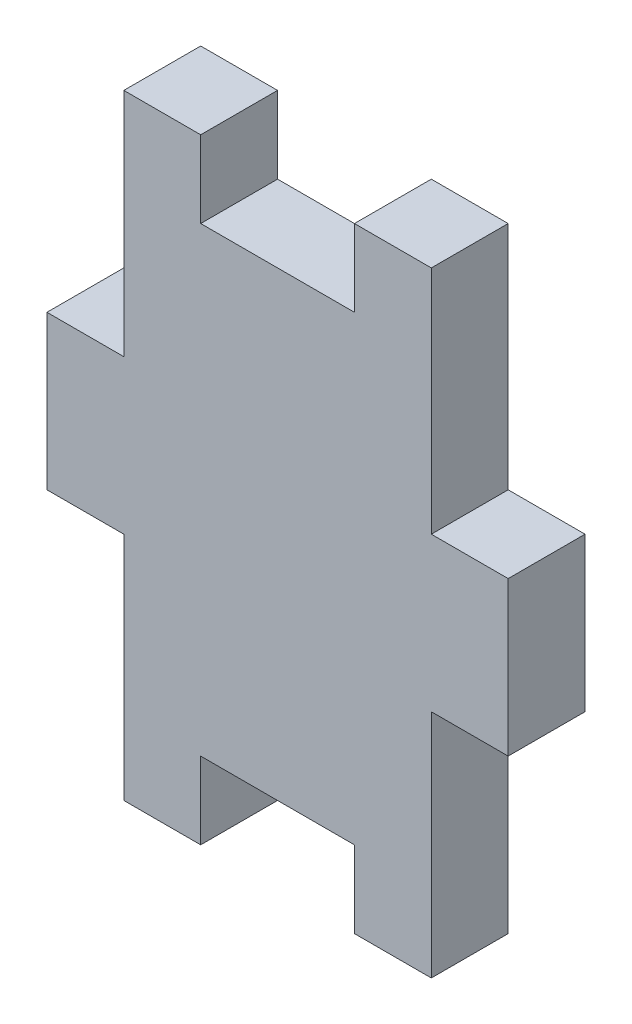
ISO-10303-21;
HEADER;
FILE_DESCRIPTION(('STEP AP214'),'2;1');
FILE_NAME('part.step','',(''),(''),'','','');
FILE_SCHEMA(('AUTOMOTIVE_DESIGN { 1 0 10303 214 1 1 1 1 }'));
ENDSEC;
DATA;
#1=APPLICATION_CONTEXT('core data for automotive mechanical design processes');
#2=APPLICATION_PROTOCOL_DEFINITION('international standard','automotive_design',2000,#1);
#3=PRODUCT_CONTEXT('',#1,'mechanical');
#4=PRODUCT('Part','Part','',(#3));
#5=PRODUCT_RELATED_PRODUCT_CATEGORY('part','',(#4));
#6=PRODUCT_DEFINITION_FORMATION('','',#4);
#7=PRODUCT_DEFINITION_CONTEXT('part definition',#1,'design');
#8=PRODUCT_DEFINITION('design','',#6,#7);
#9=PRODUCT_DEFINITION_SHAPE('','',#8);
#10=(LENGTH_UNIT() NAMED_UNIT(*) SI_UNIT(.MILLI.,.METRE.));
#11=(NAMED_UNIT(*) PLANE_ANGLE_UNIT() SI_UNIT($,.RADIAN.));
#12=(NAMED_UNIT(*) SI_UNIT($,.STERADIAN.) SOLID_ANGLE_UNIT());
#13=UNCERTAINTY_MEASURE_WITH_UNIT(LENGTH_MEASURE(1.E-05),#10,'distance_accuracy_value','');
#14=(GEOMETRIC_REPRESENTATION_CONTEXT(3) GLOBAL_UNCERTAINTY_ASSIGNED_CONTEXT((#13)) GLOBAL_UNIT_ASSIGNED_CONTEXT((#10,
#11,#12)) REPRESENTATION_CONTEXT('',''));
#15=CARTESIAN_POINT('',(0.,0.,0.));
#16=DIRECTION('',(0.,0.,1.));
#17=DIRECTION('',(1.,0.,0.));
#18=AXIS2_PLACEMENT_3D('',#15,#16,#17);
#19=CARTESIAN_POINT('',(-6.35,12.7,3.175));
#20=DIRECTION('',(1.,0.,0.));
#21=DIRECTION('',(0.,1.,0.));
#22=AXIS2_PLACEMENT_3D('',#19,#20,#21);
#23=PLANE('',#22);
#24=DIRECTION('',(0.,-1.,0.));
#25=VECTOR('',#24,1.);
#26=CARTESIAN_POINT('',(-6.35,12.7,0.));
#27=LINE('',#26,#25);
#28=CARTESIAN_POINT('',(-6.35,12.7,0.));
#29=VERTEX_POINT('',#28);
#30=CARTESIAN_POINT('',(-6.35,3.175,0.));
#31=VERTEX_POINT('',#30);
#32=EDGE_CURVE('E200',#29,#31,#27,.T.);
#33=ORIENTED_EDGE('',*,*,#32,.T.);
#34=DIRECTION('',(0.,0.,-1.));
#35=VECTOR('',#34,1.);
#36=CARTESIAN_POINT('',(-6.35,3.175,3.175));
#37=LINE('',#36,#35);
#38=CARTESIAN_POINT('',(-6.35,3.175,3.175));
#39=VERTEX_POINT('',#38);
#40=EDGE_CURVE('E11',#39,#31,#37,.T.);
#41=ORIENTED_EDGE('',*,*,#40,.F.);
#42=DIRECTION('',(0.,-1.,0.));
#43=VECTOR('',#42,1.);
#44=CARTESIAN_POINT('',(-6.35,12.7,3.175));
#45=LINE('',#44,#43);
#46=CARTESIAN_POINT('',(-6.35,12.7,3.175));
#47=VERTEX_POINT('',#46);
#48=EDGE_CURVE('E238',#47,#39,#45,.T.);
#49=ORIENTED_EDGE('',*,*,#48,.F.);
#50=DIRECTION('',(0.,0.,-1.));
#51=VECTOR('',#50,1.);
#52=CARTESIAN_POINT('',(-6.35,12.7,3.175));
#53=LINE('',#52,#51);
#54=EDGE_CURVE('E196',#47,#29,#53,.T.);
#55=ORIENTED_EDGE('',*,*,#54,.T.);
#56=EDGE_LOOP('',(#33,#41,#49,#55));
#57=FACE_BOUND('',#56,.T.);
#58=ADVANCED_FACE('F32',(#57),#23,.F.);
#59=CARTESIAN_POINT('',(-6.35,3.175,3.175));
#60=DIRECTION('',(0.,-1.,0.));
#61=DIRECTION('',(1.,0.,0.));
#62=AXIS2_PLACEMENT_3D('',#59,#60,#61);
#63=PLANE('',#62);
#64=DIRECTION('',(-1.,0.,0.));
#65=VECTOR('',#64,1.);
#66=CARTESIAN_POINT('',(-6.35,3.175,0.));
#67=LINE('',#66,#65);
#68=CARTESIAN_POINT('',(-9.525,3.175,0.));
#69=VERTEX_POINT('',#68);
#70=EDGE_CURVE('E203',#31,#69,#67,.T.);
#71=ORIENTED_EDGE('',*,*,#70,.T.);
#72=DIRECTION('',(0.,0.,-1.));
#73=VECTOR('',#72,1.);
#74=CARTESIAN_POINT('',(-9.525,3.175,3.175));
#75=LINE('',#74,#73);
#76=CARTESIAN_POINT('',(-9.525,3.175,3.175));
#77=VERTEX_POINT('',#76);
#78=EDGE_CURVE('E40',#77,#69,#75,.T.);
#79=ORIENTED_EDGE('',*,*,#78,.F.);
#80=DIRECTION('',(-1.,0.,0.));
#81=VECTOR('',#80,1.);
#82=CARTESIAN_POINT('',(-6.35,3.175,3.175));
#83=LINE('',#82,#81);
#84=EDGE_CURVE('E127',#39,#77,#83,.T.);
#85=ORIENTED_EDGE('',*,*,#84,.F.);
#86=ORIENTED_EDGE('',*,*,#40,.T.);
#87=EDGE_LOOP('',(#71,#79,#85,#86));
#88=FACE_BOUND('',#87,.T.);
#89=ADVANCED_FACE('F356',(#88),#63,.F.);
#90=CARTESIAN_POINT('',(-9.525,3.175,3.175));
#91=DIRECTION('',(1.,0.,0.));
#92=DIRECTION('',(0.,0.,-1.));
#93=AXIS2_PLACEMENT_3D('',#90,#91,#92);
#94=PLANE('',#93);
#95=DIRECTION('',(0.,-1.,0.));
#96=VECTOR('',#95,1.);
#97=CARTESIAN_POINT('',(-9.525,3.175,0.));
#98=LINE('',#97,#96);
#99=CARTESIAN_POINT('',(-9.525,-3.175,0.));
#100=VERTEX_POINT('',#99);
#101=EDGE_CURVE('E205',#69,#100,#98,.T.);
#102=ORIENTED_EDGE('',*,*,#101,.T.);
#103=DIRECTION('',(0.,0.,-1.));
#104=VECTOR('',#103,1.);
#105=CARTESIAN_POINT('',(-9.525,-3.175,3.175));
#106=LINE('',#105,#104);
#107=CARTESIAN_POINT('',(-9.525,-3.175,3.175));
#108=VERTEX_POINT('',#107);
#109=EDGE_CURVE('E281',#108,#100,#106,.T.);
#110=ORIENTED_EDGE('',*,*,#109,.F.);
#111=DIRECTION('',(0.,-1.,0.));
#112=VECTOR('',#111,1.);
#113=CARTESIAN_POINT('',(-9.525,3.175,3.175));
#114=LINE('',#113,#112);
#115=EDGE_CURVE('E289',#77,#108,#114,.T.);
#116=ORIENTED_EDGE('',*,*,#115,.F.);
#117=ORIENTED_EDGE('',*,*,#78,.T.);
#118=EDGE_LOOP('',(#102,#110,#116,#117));
#119=FACE_BOUND('',#118,.T.);
#120=ADVANCED_FACE('F287',(#119),#94,.F.);
#121=CARTESIAN_POINT('',(-6.35,-3.175,3.175));
#122=DIRECTION('',(0.,1.,0.));
#123=DIRECTION('',(-1.,0.,0.));
#124=AXIS2_PLACEMENT_3D('',#121,#122,#123);
#125=PLANE('',#124);
#126=DIRECTION('',(1.,0.,0.));
#127=VECTOR('',#126,1.);
#128=CARTESIAN_POINT('',(-6.35,-3.175,0.));
#129=LINE('',#128,#127);
#130=CARTESIAN_POINT('',(-6.35,-3.175,0.));
#131=VERTEX_POINT('',#130);
#132=EDGE_CURVE('E207',#100,#131,#129,.T.);
#133=ORIENTED_EDGE('',*,*,#132,.T.);
#134=DIRECTION('',(0.,0.,-1.));
#135=VECTOR('',#134,1.);
#136=CARTESIAN_POINT('',(-6.35,-3.175,3.175));
#137=LINE('',#136,#135);
#138=CARTESIAN_POINT('',(-6.35,-3.175,3.175));
#139=VERTEX_POINT('',#138);
#140=EDGE_CURVE('E278',#139,#131,#137,.T.);
#141=ORIENTED_EDGE('',*,*,#140,.F.);
#142=DIRECTION('',(1.,0.,0.));
#143=VECTOR('',#142,1.);
#144=CARTESIAN_POINT('',(-6.35,-3.175,3.175));
#145=LINE('',#144,#143);
#146=EDGE_CURVE('E307',#108,#139,#145,.T.);
#147=ORIENTED_EDGE('',*,*,#146,.F.);
#148=ORIENTED_EDGE('',*,*,#109,.T.);
#149=EDGE_LOOP('',(#133,#141,#147,#148));
#150=FACE_BOUND('',#149,.T.);
#151=ADVANCED_FACE('F298',(#150),#125,.F.);
#152=CARTESIAN_POINT('',(-6.35,-12.7,3.175));
#153=DIRECTION('',(1.,0.,0.));
#154=DIRECTION('',(0.,1.,0.));
#155=AXIS2_PLACEMENT_3D('',#152,#153,#154);
#156=PLANE('',#155);
#157=DIRECTION('',(0.,-1.,0.));
#158=VECTOR('',#157,1.);
#159=CARTESIAN_POINT('',(-6.35,-12.7,0.));
#160=LINE('',#159,#158);
#161=CARTESIAN_POINT('',(-6.35,-12.7,0.));
#162=VERTEX_POINT('',#161);
#163=EDGE_CURVE('E209',#131,#162,#160,.T.);
#164=ORIENTED_EDGE('',*,*,#163,.T.);
#165=DIRECTION('',(0.,0.,-1.));
#166=VECTOR('',#165,1.);
#167=CARTESIAN_POINT('',(-6.35,-12.7,3.175));
#168=LINE('',#167,#166);
#169=CARTESIAN_POINT('',(-6.35,-12.7,3.175));
#170=VERTEX_POINT('',#169);
#171=EDGE_CURVE('E275',#170,#162,#168,.T.);
#172=ORIENTED_EDGE('',*,*,#171,.F.);
#173=DIRECTION('',(0.,-1.,0.));
#174=VECTOR('',#173,1.);
#175=CARTESIAN_POINT('',(-6.35,-12.7,3.175));
#176=LINE('',#175,#174);
#177=EDGE_CURVE('E304',#139,#170,#176,.T.);
#178=ORIENTED_EDGE('',*,*,#177,.F.);
#179=ORIENTED_EDGE('',*,*,#140,.T.);
#180=EDGE_LOOP('',(#164,#172,#178,#179));
#181=FACE_BOUND('',#180,.T.);
#182=ADVANCED_FACE('F302',(#181),#156,.F.);
#183=CARTESIAN_POINT('',(-6.35,-12.7,3.175));
#184=DIRECTION('',(0.,1.,0.));
#185=DIRECTION('',(-1.,0.,0.));
#186=AXIS2_PLACEMENT_3D('',#183,#184,#185);
#187=PLANE('',#186);
#188=DIRECTION('',(1.,0.,0.));
#189=VECTOR('',#188,1.);
#190=CARTESIAN_POINT('',(-6.35,-12.7,0.));
#191=LINE('',#190,#189);
#192=CARTESIAN_POINT('',(-3.175,-12.7,0.));
#193=VERTEX_POINT('',#192);
#194=EDGE_CURVE('E211',#162,#193,#191,.T.);
#195=ORIENTED_EDGE('',*,*,#194,.T.);
#196=DIRECTION('',(0.,0.,-1.));
#197=VECTOR('',#196,1.);
#198=CARTESIAN_POINT('',(-3.175,-12.7,3.175));
#199=LINE('',#198,#197);
#200=CARTESIAN_POINT('',(-3.175,-12.7,3.175));
#201=VERTEX_POINT('',#200);
#202=EDGE_CURVE('E272',#201,#193,#199,.T.);
#203=ORIENTED_EDGE('',*,*,#202,.F.);
#204=DIRECTION('',(1.,0.,0.));
#205=VECTOR('',#204,1.);
#206=CARTESIAN_POINT('',(-6.35,-12.7,3.175));
#207=LINE('',#206,#205);
#208=EDGE_CURVE('E306',#170,#201,#207,.T.);
#209=ORIENTED_EDGE('',*,*,#208,.F.);
#210=ORIENTED_EDGE('',*,*,#171,.T.);
#211=EDGE_LOOP('',(#195,#203,#209,#210));
#212=FACE_BOUND('',#211,.T.);
#213=ADVANCED_FACE('F369',(#212),#187,.F.);
#214=CARTESIAN_POINT('',(-3.175,-12.7,3.175));
#215=DIRECTION('',(-1.,0.,0.));
#216=DIRECTION('',(0.,-1.,0.));
#217=AXIS2_PLACEMENT_3D('',#214,#215,#216);
#218=PLANE('',#217);
#219=DIRECTION('',(0.,1.,0.));
#220=VECTOR('',#219,1.);
#221=CARTESIAN_POINT('',(-3.175,-12.7,0.));
#222=LINE('',#221,#220);
#223=CARTESIAN_POINT('',(-3.175,-9.525,0.));
#224=VERTEX_POINT('',#223);
#225=EDGE_CURVE('E213',#193,#224,#222,.T.);
#226=ORIENTED_EDGE('',*,*,#225,.T.);
#227=DIRECTION('',(0.,0.,-1.));
#228=VECTOR('',#227,1.);
#229=CARTESIAN_POINT('',(-3.175,-9.525,3.175));
#230=LINE('',#229,#228);
#231=CARTESIAN_POINT('',(-3.175,-9.525,3.175));
#232=VERTEX_POINT('',#231);
#233=EDGE_CURVE('E269',#232,#224,#230,.T.);
#234=ORIENTED_EDGE('',*,*,#233,.F.);
#235=DIRECTION('',(0.,1.,0.));
#236=VECTOR('',#235,1.);
#237=CARTESIAN_POINT('',(-3.175,-12.7,3.175));
#238=LINE('',#237,#236);
#239=EDGE_CURVE('E309',#201,#232,#238,.T.);
#240=ORIENTED_EDGE('',*,*,#239,.F.);
#241=ORIENTED_EDGE('',*,*,#202,.T.);
#242=EDGE_LOOP('',(#226,#234,#240,#241));
#243=FACE_BOUND('',#242,.T.);
#244=ADVANCED_FACE('F372',(#243),#218,.F.);
#245=CARTESIAN_POINT('',(-3.175,-9.525,3.175));
#246=DIRECTION('',(0.,1.,0.));
#247=DIRECTION('',(0.,0.,1.));
#248=AXIS2_PLACEMENT_3D('',#245,#246,#247);
#249=PLANE('',#248);
#250=DIRECTION('',(1.,0.,0.));
#251=VECTOR('',#250,1.);
#252=CARTESIAN_POINT('',(-3.175,-9.525,0.));
#253=LINE('',#252,#251);
#254=CARTESIAN_POINT('',(3.175,-9.525,0.));
#255=VERTEX_POINT('',#254);
#256=EDGE_CURVE('E215',#224,#255,#253,.T.);
#257=ORIENTED_EDGE('',*,*,#256,.T.);
#258=DIRECTION('',(0.,0.,-1.));
#259=VECTOR('',#258,1.);
#260=CARTESIAN_POINT('',(3.175,-9.525,3.175));
#261=LINE('',#260,#259);
#262=CARTESIAN_POINT('',(3.175,-9.525,3.175));
#263=VERTEX_POINT('',#262);
#264=EDGE_CURVE('E266',#263,#255,#261,.T.);
#265=ORIENTED_EDGE('',*,*,#264,.F.);
#266=DIRECTION('',(1.,0.,0.));
#267=VECTOR('',#266,1.);
#268=CARTESIAN_POINT('',(-3.175,-9.525,3.175));
#269=LINE('',#268,#267);
#270=EDGE_CURVE('E315',#232,#263,#269,.T.);
#271=ORIENTED_EDGE('',*,*,#270,.F.);
#272=ORIENTED_EDGE('',*,*,#233,.T.);
#273=EDGE_LOOP('',(#257,#265,#271,#272));
#274=FACE_BOUND('',#273,.T.);
#275=ADVANCED_FACE('F376',(#274),#249,.F.);
#276=CARTESIAN_POINT('',(3.175,-9.525,3.175));
#277=DIRECTION('',(1.,0.,0.));
#278=DIRECTION('',(0.,1.,0.));
#279=AXIS2_PLACEMENT_3D('',#276,#277,#278);
#280=PLANE('',#279);
#281=DIRECTION('',(0.,-1.,0.));
#282=VECTOR('',#281,1.);
#283=CARTESIAN_POINT('',(3.175,-9.525,0.));
#284=LINE('',#283,#282);
#285=CARTESIAN_POINT('',(3.175,-12.7,0.));
#286=VERTEX_POINT('',#285);
#287=EDGE_CURVE('E217',#255,#286,#284,.T.);
#288=ORIENTED_EDGE('',*,*,#287,.T.);
#289=DIRECTION('',(0.,0.,-1.));
#290=VECTOR('',#289,1.);
#291=CARTESIAN_POINT('',(3.175,-12.7,3.175));
#292=LINE('',#291,#290);
#293=CARTESIAN_POINT('',(3.175,-12.7,3.175));
#294=VERTEX_POINT('',#293);
#295=EDGE_CURVE('E263',#294,#286,#292,.T.);
#296=ORIENTED_EDGE('',*,*,#295,.F.);
#297=DIRECTION('',(0.,-1.,0.));
#298=VECTOR('',#297,1.);
#299=CARTESIAN_POINT('',(3.175,-9.525,3.175));
#300=LINE('',#299,#298);
#301=EDGE_CURVE('E317',#263,#294,#300,.T.);
#302=ORIENTED_EDGE('',*,*,#301,.F.);
#303=ORIENTED_EDGE('',*,*,#264,.T.);
#304=EDGE_LOOP('',(#288,#296,#302,#303));
#305=FACE_BOUND('',#304,.T.);
#306=ADVANCED_FACE('F380',(#305),#280,.F.);
#307=CARTESIAN_POINT('',(6.35,-12.7,3.175));
#308=DIRECTION('',(0.,1.,0.));
#309=DIRECTION('',(-1.,0.,0.));
#310=AXIS2_PLACEMENT_3D('',#307,#308,#309);
#311=PLANE('',#310);
#312=DIRECTION('',(1.,0.,0.));
#313=VECTOR('',#312,1.);
#314=CARTESIAN_POINT('',(6.35,-12.7,0.));
#315=LINE('',#314,#313);
#316=CARTESIAN_POINT('',(6.35,-12.7,0.));
#317=VERTEX_POINT('',#316);
#318=EDGE_CURVE('E219',#286,#317,#315,.T.);
#319=ORIENTED_EDGE('',*,*,#318,.T.);
#320=DIRECTION('',(0.,0.,-1.));
#321=VECTOR('',#320,1.);
#322=CARTESIAN_POINT('',(6.35,-12.7,3.175));
#323=LINE('',#322,#321);
#324=CARTESIAN_POINT('',(6.35,-12.7,3.175));
#325=VERTEX_POINT('',#324);
#326=EDGE_CURVE('E260',#325,#317,#323,.T.);
#327=ORIENTED_EDGE('',*,*,#326,.F.);
#328=DIRECTION('',(1.,0.,0.));
#329=VECTOR('',#328,1.);
#330=CARTESIAN_POINT('',(6.35,-12.7,3.175));
#331=LINE('',#330,#329);
#332=EDGE_CURVE('E319',#294,#325,#331,.T.);
#333=ORIENTED_EDGE('',*,*,#332,.F.);
#334=ORIENTED_EDGE('',*,*,#295,.T.);
#335=EDGE_LOOP('',(#319,#327,#333,#334));
#336=FACE_BOUND('',#335,.T.);
#337=ADVANCED_FACE('F384',(#336),#311,.F.);
#338=CARTESIAN_POINT('',(6.35,-12.7,3.175));
#339=DIRECTION('',(-1.,0.,0.));
#340=DIRECTION('',(0.,-1.,0.));
#341=AXIS2_PLACEMENT_3D('',#338,#339,#340);
#342=PLANE('',#341);
#343=DIRECTION('',(0.,1.,0.));
#344=VECTOR('',#343,1.);
#345=CARTESIAN_POINT('',(6.35,-12.7,0.));
#346=LINE('',#345,#344);
#347=CARTESIAN_POINT('',(6.35,-3.175,0.));
#348=VERTEX_POINT('',#347);
#349=EDGE_CURVE('E221',#317,#348,#346,.T.);
#350=ORIENTED_EDGE('',*,*,#349,.T.);
#351=DIRECTION('',(0.,0.,-1.));
#352=VECTOR('',#351,1.);
#353=CARTESIAN_POINT('',(6.35,-3.175,3.175));
#354=LINE('',#353,#352);
#355=CARTESIAN_POINT('',(6.35,-3.175,3.175));
#356=VERTEX_POINT('',#355);
#357=EDGE_CURVE('E257',#356,#348,#354,.T.);
#358=ORIENTED_EDGE('',*,*,#357,.F.);
#359=DIRECTION('',(0.,1.,0.));
#360=VECTOR('',#359,1.);
#361=CARTESIAN_POINT('',(6.35,-12.7,3.175));
#362=LINE('',#361,#360);
#363=EDGE_CURVE('E321',#325,#356,#362,.T.);
#364=ORIENTED_EDGE('',*,*,#363,.F.);
#365=ORIENTED_EDGE('',*,*,#326,.T.);
#366=EDGE_LOOP('',(#350,#358,#364,#365));
#367=FACE_BOUND('',#366,.T.);
#368=ADVANCED_FACE('F388',(#367),#342,.F.);
#369=CARTESIAN_POINT('',(6.35,-3.175,3.175));
#370=DIRECTION('',(0.,1.,0.));
#371=DIRECTION('',(-1.,0.,0.));
#372=AXIS2_PLACEMENT_3D('',#369,#370,#371);
#373=PLANE('',#372);
#374=DIRECTION('',(1.,0.,0.));
#375=VECTOR('',#374,1.);
#376=CARTESIAN_POINT('',(6.35,-3.175,0.));
#377=LINE('',#376,#375);
#378=CARTESIAN_POINT('',(9.525,-3.175,0.));
#379=VERTEX_POINT('',#378);
#380=EDGE_CURVE('E223',#348,#379,#377,.T.);
#381=ORIENTED_EDGE('',*,*,#380,.T.);
#382=DIRECTION('',(0.,0.,-1.));
#383=VECTOR('',#382,1.);
#384=CARTESIAN_POINT('',(9.525,-3.175,3.175));
#385=LINE('',#384,#383);
#386=CARTESIAN_POINT('',(9.525,-3.175,3.175));
#387=VERTEX_POINT('',#386);
#388=EDGE_CURVE('E254',#387,#379,#385,.T.);
#389=ORIENTED_EDGE('',*,*,#388,.F.);
#390=DIRECTION('',(1.,0.,0.));
#391=VECTOR('',#390,1.);
#392=CARTESIAN_POINT('',(6.35,-3.175,3.175));
#393=LINE('',#392,#391);
#394=EDGE_CURVE('E323',#356,#387,#393,.T.);
#395=ORIENTED_EDGE('',*,*,#394,.F.);
#396=ORIENTED_EDGE('',*,*,#357,.T.);
#397=EDGE_LOOP('',(#381,#389,#395,#396));
#398=FACE_BOUND('',#397,.T.);
#399=ADVANCED_FACE('F392',(#398),#373,.F.);
#400=CARTESIAN_POINT('',(9.525,3.175,3.175));
#401=DIRECTION('',(-1.,0.,0.));
#402=DIRECTION('',(0.,0.,1.));
#403=AXIS2_PLACEMENT_3D('',#400,#401,#402);
#404=PLANE('',#403);
#405=DIRECTION('',(0.,1.,0.));
#406=VECTOR('',#405,1.);
#407=CARTESIAN_POINT('',(9.525,3.175,0.));
#408=LINE('',#407,#406);
#409=CARTESIAN_POINT('',(9.525,3.175,0.));
#410=VERTEX_POINT('',#409);
#411=EDGE_CURVE('E225',#379,#410,#408,.T.);
#412=ORIENTED_EDGE('',*,*,#411,.T.);
#413=DIRECTION('',(0.,0.,-1.));
#414=VECTOR('',#413,1.);
#415=CARTESIAN_POINT('',(9.525,3.175,3.175));
#416=LINE('',#415,#414);
#417=CARTESIAN_POINT('',(9.525,3.175,3.175));
#418=VERTEX_POINT('',#417);
#419=EDGE_CURVE('E251',#418,#410,#416,.T.);
#420=ORIENTED_EDGE('',*,*,#419,.F.);
#421=DIRECTION('',(0.,1.,0.));
#422=VECTOR('',#421,1.);
#423=CARTESIAN_POINT('',(9.525,3.175,3.175));
#424=LINE('',#423,#422);
#425=EDGE_CURVE('E325',#387,#418,#424,.T.);
#426=ORIENTED_EDGE('',*,*,#425,.F.);
#427=ORIENTED_EDGE('',*,*,#388,.T.);
#428=EDGE_LOOP('',(#412,#420,#426,#427));
#429=FACE_BOUND('',#428,.T.);
#430=ADVANCED_FACE('F396',(#429),#404,.F.);
#431=CARTESIAN_POINT('',(6.35,3.175,3.175));
#432=DIRECTION('',(0.,-1.,0.));
#433=DIRECTION('',(1.,0.,0.));
#434=AXIS2_PLACEMENT_3D('',#431,#432,#433);
#435=PLANE('',#434);
#436=DIRECTION('',(-1.,0.,0.));
#437=VECTOR('',#436,1.);
#438=CARTESIAN_POINT('',(6.35,3.175,0.));
#439=LINE('',#438,#437);
#440=CARTESIAN_POINT('',(6.35,3.175,0.));
#441=VERTEX_POINT('',#440);
#442=EDGE_CURVE('E227',#410,#441,#439,.T.);
#443=ORIENTED_EDGE('',*,*,#442,.T.);
#444=DIRECTION('',(0.,0.,-1.));
#445=VECTOR('',#444,1.);
#446=CARTESIAN_POINT('',(6.35,3.175,3.175));
#447=LINE('',#446,#445);
#448=CARTESIAN_POINT('',(6.35,3.175,3.175));
#449=VERTEX_POINT('',#448);
#450=EDGE_CURVE('E248',#449,#441,#447,.T.);
#451=ORIENTED_EDGE('',*,*,#450,.F.);
#452=DIRECTION('',(-1.,0.,0.));
#453=VECTOR('',#452,1.);
#454=CARTESIAN_POINT('',(6.35,3.175,3.175));
#455=LINE('',#454,#453);
#456=EDGE_CURVE('E327',#418,#449,#455,.T.);
#457=ORIENTED_EDGE('',*,*,#456,.F.);
#458=ORIENTED_EDGE('',*,*,#419,.T.);
#459=EDGE_LOOP('',(#443,#451,#457,#458));
#460=FACE_BOUND('',#459,.T.);
#461=ADVANCED_FACE('F400',(#460),#435,.F.);
#462=CARTESIAN_POINT('',(6.35,12.7,3.175));
#463=DIRECTION('',(-1.,0.,0.));
#464=DIRECTION('',(0.,-1.,0.));
#465=AXIS2_PLACEMENT_3D('',#462,#463,#464);
#466=PLANE('',#465);
#467=DIRECTION('',(0.,1.,0.));
#468=VECTOR('',#467,1.);
#469=CARTESIAN_POINT('',(6.35,12.7,0.));
#470=LINE('',#469,#468);
#471=CARTESIAN_POINT('',(6.35,12.7,0.));
#472=VERTEX_POINT('',#471);
#473=EDGE_CURVE('E229',#441,#472,#470,.T.);
#474=ORIENTED_EDGE('',*,*,#473,.T.);
#475=DIRECTION('',(0.,0.,-1.));
#476=VECTOR('',#475,1.);
#477=CARTESIAN_POINT('',(6.35,12.7,3.175));
#478=LINE('',#477,#476);
#479=CARTESIAN_POINT('',(6.35,12.7,3.175));
#480=VERTEX_POINT('',#479);
#481=EDGE_CURVE('E245',#480,#472,#478,.T.);
#482=ORIENTED_EDGE('',*,*,#481,.F.);
#483=DIRECTION('',(0.,1.,0.));
#484=VECTOR('',#483,1.);
#485=CARTESIAN_POINT('',(6.35,12.7,3.175));
#486=LINE('',#485,#484);
#487=EDGE_CURVE('E329',#449,#480,#486,.T.);
#488=ORIENTED_EDGE('',*,*,#487,.F.);
#489=ORIENTED_EDGE('',*,*,#450,.T.);
#490=EDGE_LOOP('',(#474,#482,#488,#489));
#491=FACE_BOUND('',#490,.T.);
#492=ADVANCED_FACE('F404',(#491),#466,.F.);
#493=CARTESIAN_POINT('',(6.35,12.7,3.175));
#494=DIRECTION('',(0.,-1.,0.));
#495=DIRECTION('',(1.,0.,0.));
#496=AXIS2_PLACEMENT_3D('',#493,#494,#495);
#497=PLANE('',#496);
#498=DIRECTION('',(-1.,0.,0.));
#499=VECTOR('',#498,1.);
#500=CARTESIAN_POINT('',(6.35,12.7,0.));
#501=LINE('',#500,#499);
#502=CARTESIAN_POINT('',(3.175,12.7,0.));
#503=VERTEX_POINT('',#502);
#504=EDGE_CURVE('E231',#472,#503,#501,.T.);
#505=ORIENTED_EDGE('',*,*,#504,.T.);
#506=DIRECTION('',(0.,0.,-1.));
#507=VECTOR('',#506,1.);
#508=CARTESIAN_POINT('',(3.175,12.7,3.175));
#509=LINE('',#508,#507);
#510=CARTESIAN_POINT('',(3.175,12.7,3.175));
#511=VERTEX_POINT('',#510);
#512=EDGE_CURVE('E242',#511,#503,#509,.T.);
#513=ORIENTED_EDGE('',*,*,#512,.F.);
#514=DIRECTION('',(-1.,0.,0.));
#515=VECTOR('',#514,1.);
#516=CARTESIAN_POINT('',(6.35,12.7,3.175));
#517=LINE('',#516,#515);
#518=EDGE_CURVE('E331',#480,#511,#517,.T.);
#519=ORIENTED_EDGE('',*,*,#518,.F.);
#520=ORIENTED_EDGE('',*,*,#481,.T.);
#521=EDGE_LOOP('',(#505,#513,#519,#520));
#522=FACE_BOUND('',#521,.T.);
#523=ADVANCED_FACE('F337',(#522),#497,.F.);
#524=CARTESIAN_POINT('',(3.175,9.525,3.175));
#525=DIRECTION('',(1.,0.,0.));
#526=DIRECTION('',(0.,1.,0.));
#527=AXIS2_PLACEMENT_3D('',#524,#525,#526);
#528=PLANE('',#527);
#529=DIRECTION('',(0.,-1.,0.));
#530=VECTOR('',#529,1.);
#531=CARTESIAN_POINT('',(3.175,9.525,0.));
#532=LINE('',#531,#530);
#533=CARTESIAN_POINT('',(3.175,9.525,0.));
#534=VERTEX_POINT('',#533);
#535=EDGE_CURVE('E233',#503,#534,#532,.T.);
#536=ORIENTED_EDGE('',*,*,#535,.T.);
#537=DIRECTION('',(0.,0.,-1.));
#538=VECTOR('',#537,1.);
#539=CARTESIAN_POINT('',(3.175,9.525,3.175));
#540=LINE('',#539,#538);
#541=CARTESIAN_POINT('',(3.175,9.525,3.175));
#542=VERTEX_POINT('',#541);
#543=EDGE_CURVE('E191',#542,#534,#540,.T.);
#544=ORIENTED_EDGE('',*,*,#543,.F.);
#545=DIRECTION('',(0.,-1.,0.));
#546=VECTOR('',#545,1.);
#547=CARTESIAN_POINT('',(3.175,9.525,3.175));
#548=LINE('',#547,#546);
#549=EDGE_CURVE('E182',#511,#542,#548,.T.);
#550=ORIENTED_EDGE('',*,*,#549,.F.);
#551=ORIENTED_EDGE('',*,*,#512,.T.);
#552=EDGE_LOOP('',(#536,#544,#550,#551));
#553=FACE_BOUND('',#552,.T.);
#554=ADVANCED_FACE('F341',(#553),#528,.F.);
#555=CARTESIAN_POINT('',(-3.175,9.525,3.175));
#556=DIRECTION('',(0.,-1.,0.));
#557=DIRECTION('',(1.,0.,0.));
#558=AXIS2_PLACEMENT_3D('',#555,#556,#557);
#559=PLANE('',#558);
#560=DIRECTION('',(-1.,0.,0.));
#561=VECTOR('',#560,1.);
#562=CARTESIAN_POINT('',(-3.175,9.525,0.));
#563=LINE('',#562,#561);
#564=CARTESIAN_POINT('',(-3.175,9.525,0.));
#565=VERTEX_POINT('',#564);
#566=EDGE_CURVE('E190',#534,#565,#563,.T.);
#567=ORIENTED_EDGE('',*,*,#566,.T.);
#568=DIRECTION('',(0.,0.,-1.));
#569=VECTOR('',#568,1.);
#570=CARTESIAN_POINT('',(-3.175,9.525,3.175));
#571=LINE('',#570,#569);
#572=CARTESIAN_POINT('',(-3.175,9.525,3.175));
#573=VERTEX_POINT('',#572);
#574=EDGE_CURVE('E187',#573,#565,#571,.T.);
#575=ORIENTED_EDGE('',*,*,#574,.F.);
#576=DIRECTION('',(-1.,0.,0.));
#577=VECTOR('',#576,1.);
#578=CARTESIAN_POINT('',(-3.175,9.525,3.175));
#579=LINE('',#578,#577);
#580=EDGE_CURVE('E176',#542,#573,#579,.T.);
#581=ORIENTED_EDGE('',*,*,#580,.F.);
#582=ORIENTED_EDGE('',*,*,#543,.T.);
#583=EDGE_LOOP('',(#567,#575,#581,#582));
#584=FACE_BOUND('',#583,.T.);
#585=ADVANCED_FACE('F188',(#584),#559,.F.);
#586=CARTESIAN_POINT('',(-3.175,12.7,3.175));
#587=DIRECTION('',(-1.,0.,0.));
#588=DIRECTION('',(0.,-1.,0.));
#589=AXIS2_PLACEMENT_3D('',#586,#587,#588);
#590=PLANE('',#589);
#591=DIRECTION('',(0.,1.,0.));
#592=VECTOR('',#591,1.);
#593=CARTESIAN_POINT('',(-3.175,12.7,0.));
#594=LINE('',#593,#592);
#595=CARTESIAN_POINT('',(-3.175,12.7,0.));
#596=VERTEX_POINT('',#595);
#597=EDGE_CURVE('E113',#565,#596,#594,.T.);
#598=ORIENTED_EDGE('',*,*,#597,.T.);
#599=DIRECTION('',(0.,0.,-1.));
#600=VECTOR('',#599,1.);
#601=CARTESIAN_POINT('',(-3.175,12.7,3.175));
#602=LINE('',#601,#600);
#603=CARTESIAN_POINT('',(-3.175,12.7,3.175));
#604=VERTEX_POINT('',#603);
#605=EDGE_CURVE('E192',#604,#596,#602,.T.);
#606=ORIENTED_EDGE('',*,*,#605,.F.);
#607=DIRECTION('',(0.,1.,0.));
#608=VECTOR('',#607,1.);
#609=CARTESIAN_POINT('',(-3.175,12.7,3.175));
#610=LINE('',#609,#608);
#611=EDGE_CURVE('E180',#573,#604,#610,.T.);
#612=ORIENTED_EDGE('',*,*,#611,.F.);
#613=ORIENTED_EDGE('',*,*,#574,.T.);
#614=EDGE_LOOP('',(#598,#606,#612,#613));
#615=FACE_BOUND('',#614,.T.);
#616=ADVANCED_FACE('F194',(#615),#590,.F.);
#617=CARTESIAN_POINT('',(-6.35,12.7,3.175));
#618=DIRECTION('',(0.,-1.,0.));
#619=DIRECTION('',(1.,0.,0.));
#620=AXIS2_PLACEMENT_3D('',#617,#618,#619);
#621=PLANE('',#620);
#622=DIRECTION('',(-1.,0.,0.));
#623=VECTOR('',#622,1.);
#624=CARTESIAN_POINT('',(-6.35,12.7,0.));
#625=LINE('',#624,#623);
#626=EDGE_CURVE('E119',#596,#29,#625,.T.);
#627=ORIENTED_EDGE('',*,*,#626,.T.);
#628=ORIENTED_EDGE('',*,*,#54,.F.);
#629=DIRECTION('',(-1.,0.,0.));
#630=VECTOR('',#629,1.);
#631=CARTESIAN_POINT('',(-6.35,12.7,3.175));
#632=LINE('',#631,#630);
#633=EDGE_CURVE('E48',#604,#47,#632,.T.);
#634=ORIENTED_EDGE('',*,*,#633,.F.);
#635=ORIENTED_EDGE('',*,*,#605,.T.);
#636=EDGE_LOOP('',(#627,#628,#634,#635));
#637=FACE_BOUND('',#636,.T.);
#638=ADVANCED_FACE('F345',(#637),#621,.F.);
#639=CARTESIAN_POINT('',(-6.35,-3.175,3.175));
#640=DIRECTION('',(0.,0.,-1.));
#641=DIRECTION('',(-1.,0.,0.));
#642=AXIS2_PLACEMENT_3D('',#639,#640,#641);
#643=PLANE('',#642);
#644=ORIENTED_EDGE('',*,*,#48,.T.);
#645=ORIENTED_EDGE('',*,*,#84,.T.);
#646=ORIENTED_EDGE('',*,*,#115,.T.);
#647=ORIENTED_EDGE('',*,*,#146,.T.);
#648=ORIENTED_EDGE('',*,*,#177,.T.);
#649=ORIENTED_EDGE('',*,*,#208,.T.);
#650=ORIENTED_EDGE('',*,*,#239,.T.);
#651=ORIENTED_EDGE('',*,*,#270,.T.);
#652=ORIENTED_EDGE('',*,*,#301,.T.);
#653=ORIENTED_EDGE('',*,*,#332,.T.);
#654=ORIENTED_EDGE('',*,*,#363,.T.);
#655=ORIENTED_EDGE('',*,*,#394,.T.);
#656=ORIENTED_EDGE('',*,*,#425,.T.);
#657=ORIENTED_EDGE('',*,*,#456,.T.);
#658=ORIENTED_EDGE('',*,*,#487,.T.);
#659=ORIENTED_EDGE('',*,*,#518,.T.);
#660=ORIENTED_EDGE('',*,*,#549,.T.);
#661=ORIENTED_EDGE('',*,*,#580,.T.);
#662=ORIENTED_EDGE('',*,*,#611,.T.);
#663=ORIENTED_EDGE('',*,*,#633,.T.);
#664=EDGE_LOOP('',(#644,#645,#646,#647,#648,#649,#650,#651,#652,#653,#654,#655,#656,#657,#658,
#659,#660,#661,#662,#663));
#665=FACE_BOUND('',#664,.T.);
#666=ADVANCED_FACE('F178',(#665),#643,.F.);
#667=CARTESIAN_POINT('',(-6.35,-3.175,0.));
#668=DIRECTION('',(0.,0.,-1.));
#669=DIRECTION('',(-1.,0.,0.));
#670=AXIS2_PLACEMENT_3D('',#667,#668,#669);
#671=PLANE('',#670);
#672=ORIENTED_EDGE('',*,*,#32,.F.);
#673=ORIENTED_EDGE('',*,*,#626,.F.);
#674=ORIENTED_EDGE('',*,*,#597,.F.);
#675=ORIENTED_EDGE('',*,*,#566,.F.);
#676=ORIENTED_EDGE('',*,*,#535,.F.);
#677=ORIENTED_EDGE('',*,*,#504,.F.);
#678=ORIENTED_EDGE('',*,*,#473,.F.);
#679=ORIENTED_EDGE('',*,*,#442,.F.);
#680=ORIENTED_EDGE('',*,*,#411,.F.);
#681=ORIENTED_EDGE('',*,*,#380,.F.);
#682=ORIENTED_EDGE('',*,*,#349,.F.);
#683=ORIENTED_EDGE('',*,*,#318,.F.);
#684=ORIENTED_EDGE('',*,*,#287,.F.);
#685=ORIENTED_EDGE('',*,*,#256,.F.);
#686=ORIENTED_EDGE('',*,*,#225,.F.);
#687=ORIENTED_EDGE('',*,*,#194,.F.);
#688=ORIENTED_EDGE('',*,*,#163,.F.);
#689=ORIENTED_EDGE('',*,*,#132,.F.);
#690=ORIENTED_EDGE('',*,*,#101,.F.);
#691=ORIENTED_EDGE('',*,*,#70,.F.);
#692=EDGE_LOOP('',(#672,#673,#674,#675,#676,#677,#678,#679,#680,#681,#682,#683,#684,#685,#686,
#687,#688,#689,#690,#691));
#693=FACE_BOUND('',#692,.T.);
#694=ADVANCED_FACE('F293',(#693),#671,.T.);
#695=CLOSED_SHELL('',(#58,#89,#120,#151,#182,#213,#244,#275,#306,#337,#368,#399,#430,#461,#492,
#523,#554,#585,#616,#638,#666,#694));
#696=MANIFOLD_SOLID_BREP('B2',#695);
#697=ADVANCED_BREP_SHAPE_REPRESENTATION('',(#18,#696),#14);
#698=SHAPE_DEFINITION_REPRESENTATION(#9,#697);
ENDSEC;
END-ISO-10303-21;
